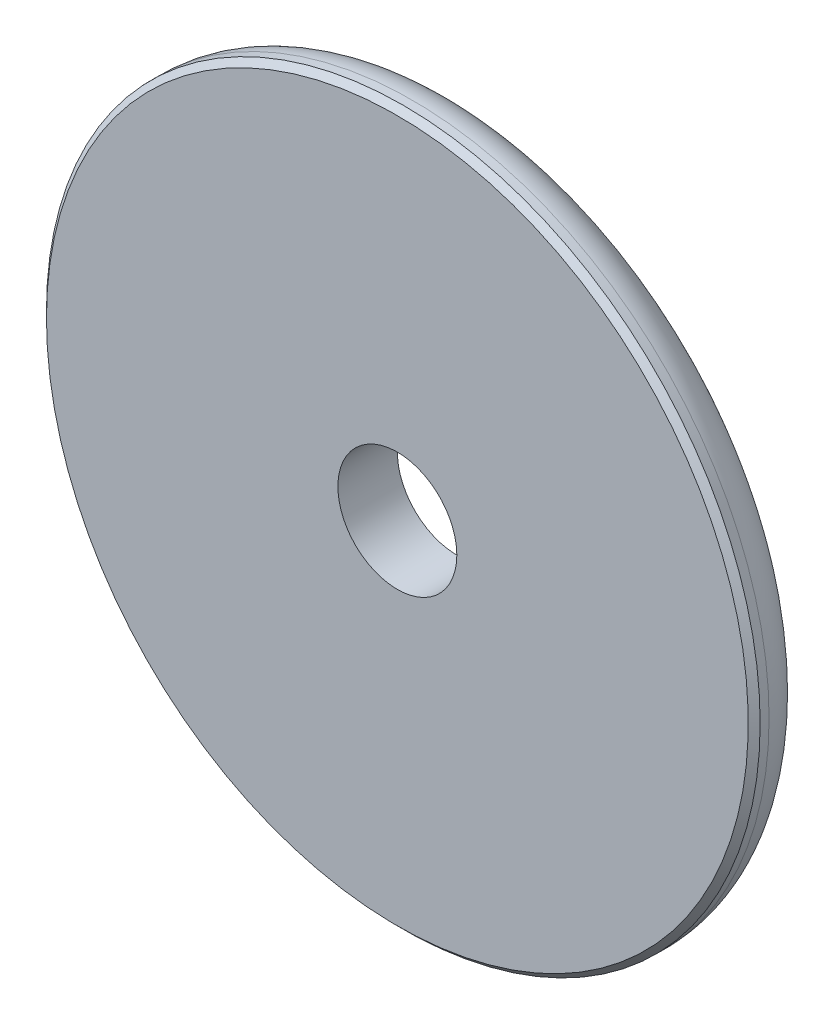
ISO-10303-21;
HEADER;
FILE_DESCRIPTION(('STEP AP214'),'2;1');
FILE_NAME('part.step','',(''),(''),'','','');
FILE_SCHEMA(('AUTOMOTIVE_DESIGN { 1 0 10303 214 1 1 1 1 }'));
ENDSEC;
DATA;
#1=APPLICATION_CONTEXT('core data for automotive mechanical design processes');
#2=APPLICATION_PROTOCOL_DEFINITION('international standard','automotive_design',2000,#1);
#3=PRODUCT_CONTEXT('',#1,'mechanical');
#4=PRODUCT('Part','Part','',(#3));
#5=PRODUCT_RELATED_PRODUCT_CATEGORY('part','',(#4));
#6=PRODUCT_DEFINITION_FORMATION('','',#4);
#7=PRODUCT_DEFINITION_CONTEXT('part definition',#1,'design');
#8=PRODUCT_DEFINITION('design','',#6,#7);
#9=PRODUCT_DEFINITION_SHAPE('','',#8);
#10=(LENGTH_UNIT() NAMED_UNIT(*) SI_UNIT(.MILLI.,.METRE.));
#11=(NAMED_UNIT(*) PLANE_ANGLE_UNIT() SI_UNIT($,.RADIAN.));
#12=(NAMED_UNIT(*) SI_UNIT($,.STERADIAN.) SOLID_ANGLE_UNIT());
#13=UNCERTAINTY_MEASURE_WITH_UNIT(LENGTH_MEASURE(1.E-05),#10,'distance_accuracy_value','');
#14=(GEOMETRIC_REPRESENTATION_CONTEXT(3) GLOBAL_UNCERTAINTY_ASSIGNED_CONTEXT((#13)) GLOBAL_UNIT_ASSIGNED_CONTEXT((#10,
#11,#12)) REPRESENTATION_CONTEXT('',''));
#15=CARTESIAN_POINT('',(0.,0.,0.));
#16=DIRECTION('',(0.,0.,1.));
#17=DIRECTION('',(1.,0.,0.));
#18=AXIS2_PLACEMENT_3D('',#15,#16,#17);
#19=CARTESIAN_POINT('',(0.,0.,1.5));
#20=DIRECTION('',(0.,0.,-1.));
#21=DIRECTION('',(-1.,0.,0.));
#22=AXIS2_PLACEMENT_3D('',#19,#20,#21);
#23=TOROIDAL_SURFACE('',#22,10.5,1.5);
#24=CARTESIAN_POINT('',(0.,0.,0.));
#25=DIRECTION('',(0.,0.,-1.));
#26=DIRECTION('',(-1.,0.,0.));
#27=AXIS2_PLACEMENT_3D('',#24,#25,#26);
#28=CIRCLE('',#27,10.5);
#29=CARTESIAN_POINT('',(-10.5,0.,0.));
#30=VERTEX_POINT('',#29);
#31=EDGE_CURVE('E29',#30,#30,#28,.F.);
#32=ORIENTED_EDGE('',*,*,#31,.T.);
#33=EDGE_LOOP('',(#32));
#34=FACE_BOUND('',#33,.T.);
#35=CARTESIAN_POINT('',(0.,0.,1.5));
#36=DIRECTION('',(0.,0.,1.));
#37=DIRECTION('',(1.,0.,0.));
#38=AXIS2_PLACEMENT_3D('',#35,#36,#37);
#39=CIRCLE('',#38,12.);
#40=CARTESIAN_POINT('',(12.,0.,1.5));
#41=VERTEX_POINT('',#40);
#42=EDGE_CURVE('E32',#41,#41,#39,.T.);
#43=ORIENTED_EDGE('',*,*,#42,.F.);
#44=EDGE_LOOP('',(#43));
#45=FACE_BOUND('',#44,.T.);
#46=ADVANCED_FACE('F15',(#34,#45),#23,.T.);
#47=CARTESIAN_POINT('',(0.,0.,0.));
#48=DIRECTION('',(0.,0.,1.));
#49=DIRECTION('',(1.,0.,0.));
#50=AXIS2_PLACEMENT_3D('',#47,#48,#49);
#51=PLANE('',#50);
#52=ORIENTED_EDGE('',*,*,#31,.F.);
#53=EDGE_LOOP('',(#52));
#54=FACE_BOUND('',#53,.T.);
#55=CARTESIAN_POINT('',(0.,0.,0.));
#56=DIRECTION('',(0.,0.,1.));
#57=DIRECTION('',(1.,0.,0.));
#58=AXIS2_PLACEMENT_3D('',#55,#56,#57);
#59=CIRCLE('',#58,2.);
#60=CARTESIAN_POINT('',(2.,0.,0.));
#61=VERTEX_POINT('',#60);
#62=EDGE_CURVE('E18',#61,#61,#59,.T.);
#63=ORIENTED_EDGE('',*,*,#62,.T.);
#64=EDGE_LOOP('',(#63));
#65=FACE_BOUND('',#64,.T.);
#66=ADVANCED_FACE('F41',(#54,#65),#51,.F.);
#67=CARTESIAN_POINT('',(0.,0.,0.));
#68=DIRECTION('',(0.,0.,1.));
#69=DIRECTION('',(1.,0.,0.));
#70=AXIS2_PLACEMENT_3D('',#67,#68,#69);
#71=CYLINDRICAL_SURFACE('',#70,12.);
#72=CARTESIAN_POINT('',(0.,0.,1.80000000000025));
#73=DIRECTION('',(0.,0.,-1.));
#74=DIRECTION('',(0.,1.,0.));
#75=AXIS2_PLACEMENT_3D('',#72,#73,#74);
#76=CIRCLE('',#75,12.0000000000003);
#77=CARTESIAN_POINT('',(0.,12.0000000000003,1.80000000000025));
#78=VERTEX_POINT('',#77);
#79=EDGE_CURVE('E27',#78,#78,#76,.F.);
#80=ORIENTED_EDGE('',*,*,#79,.F.);
#81=EDGE_LOOP('',(#80));
#82=FACE_BOUND('',#81,.T.);
#83=ORIENTED_EDGE('',*,*,#42,.T.);
#84=EDGE_LOOP('',(#83));
#85=FACE_BOUND('',#84,.T.);
#86=ADVANCED_FACE('F47',(#82,#85),#71,.T.);
#87=CARTESIAN_POINT('',(0.,0.,0.));
#88=DIRECTION('',(0.,0.,1.));
#89=DIRECTION('',(1.,0.,0.));
#90=AXIS2_PLACEMENT_3D('',#87,#88,#89);
#91=CYLINDRICAL_SURFACE('',#90,2.);
#92=ORIENTED_EDGE('',*,*,#62,.F.);
#93=EDGE_LOOP('',(#92));
#94=FACE_BOUND('',#93,.T.);
#95=CARTESIAN_POINT('',(0.,0.,2.));
#96=DIRECTION('',(0.,0.,1.));
#97=DIRECTION('',(1.,0.,0.));
#98=AXIS2_PLACEMENT_3D('',#95,#96,#97);
#99=CIRCLE('',#98,2.);
#100=CARTESIAN_POINT('',(2.,0.,2.));
#101=VERTEX_POINT('',#100);
#102=EDGE_CURVE('E22',#101,#101,#99,.F.);
#103=ORIENTED_EDGE('',*,*,#102,.F.);
#104=EDGE_LOOP('',(#103));
#105=FACE_BOUND('',#104,.T.);
#106=ADVANCED_FACE('F43',(#94,#105),#91,.F.);
#107=CARTESIAN_POINT('',(0.,0.,1.80000000000025));
#108=DIRECTION('',(0.,0.,-1.));
#109=DIRECTION('',(-1.,0.,0.));
#110=AXIS2_PLACEMENT_3D('',#107,#108,#109);
#111=CONICAL_SURFACE('',#110,12.0000000000003,0.785398163400002);
#112=ORIENTED_EDGE('',*,*,#79,.T.);
#113=EDGE_LOOP('',(#112));
#114=FACE_BOUND('',#113,.T.);
#115=CARTESIAN_POINT('',(0.,0.,1.99999999999975));
#116=DIRECTION('',(0.,0.,-1.));
#117=DIRECTION('',(-1.,0.,0.));
#118=AXIS2_PLACEMENT_3D('',#115,#116,#117);
#119=CIRCLE('',#118,11.7999999999997);
#120=CARTESIAN_POINT('',(-11.7999999999997,0.,1.99999999999975));
#121=VERTEX_POINT('',#120);
#122=EDGE_CURVE('E10',#121,#121,#119,.F.);
#123=ORIENTED_EDGE('',*,*,#122,.F.);
#124=EDGE_LOOP('',(#123));
#125=FACE_BOUND('',#124,.T.);
#126=ADVANCED_FACE('F46',(#114,#125),#111,.T.);
#127=CARTESIAN_POINT('',(0.,0.,2.));
#128=DIRECTION('',(0.,0.,1.));
#129=DIRECTION('',(1.,0.,0.));
#130=AXIS2_PLACEMENT_3D('',#127,#128,#129);
#131=PLANE('',#130);
#132=ORIENTED_EDGE('',*,*,#122,.T.);
#133=EDGE_LOOP('',(#132));
#134=FACE_BOUND('',#133,.T.);
#135=ORIENTED_EDGE('',*,*,#102,.T.);
#136=EDGE_LOOP('',(#135));
#137=FACE_BOUND('',#136,.T.);
#138=ADVANCED_FACE('F51',(#134,#137),#131,.T.);
#139=CLOSED_SHELL('',(#46,#66,#86,#106,#126,#138));
#140=MANIFOLD_SOLID_BREP('B1',#139);
#141=ADVANCED_BREP_SHAPE_REPRESENTATION('',(#18,#140),#14);
#142=SHAPE_DEFINITION_REPRESENTATION(#9,#141);
ENDSEC;
END-ISO-10303-21;
